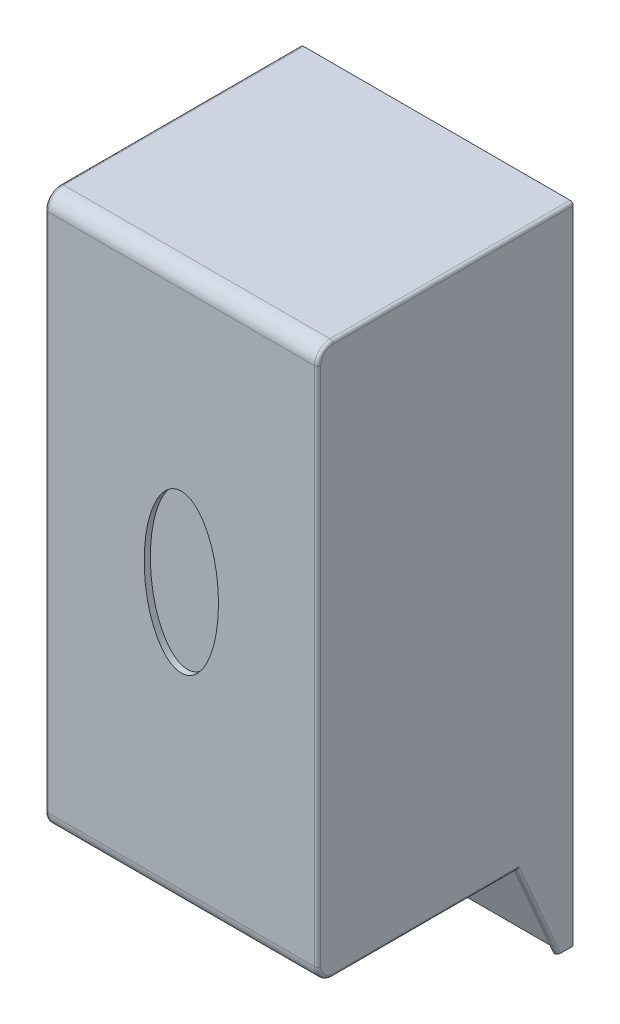
ISO-10303-21;
HEADER;
FILE_DESCRIPTION(('STEP AP214'),'2;1');
FILE_NAME('part.step','',(''),(''),'','','');
FILE_SCHEMA(('AUTOMOTIVE_DESIGN { 1 0 10303 214 1 1 1 1 }'));
ENDSEC;
DATA;
#1=APPLICATION_CONTEXT('core data for automotive mechanical design processes');
#2=APPLICATION_PROTOCOL_DEFINITION('international standard','automotive_design',2000,#1);
#3=PRODUCT_CONTEXT('',#1,'mechanical');
#4=PRODUCT('Part','Part','',(#3));
#5=PRODUCT_RELATED_PRODUCT_CATEGORY('part','',(#4));
#6=PRODUCT_DEFINITION_FORMATION('','',#4);
#7=PRODUCT_DEFINITION_CONTEXT('part definition',#1,'design');
#8=PRODUCT_DEFINITION('design','',#6,#7);
#9=PRODUCT_DEFINITION_SHAPE('','',#8);
#10=(LENGTH_UNIT() NAMED_UNIT(*) SI_UNIT(.MILLI.,.METRE.));
#11=(NAMED_UNIT(*) PLANE_ANGLE_UNIT() SI_UNIT($,.RADIAN.));
#12=(NAMED_UNIT(*) SI_UNIT($,.STERADIAN.) SOLID_ANGLE_UNIT());
#13=UNCERTAINTY_MEASURE_WITH_UNIT(LENGTH_MEASURE(1.E-05),#10,'distance_accuracy_value','');
#14=(GEOMETRIC_REPRESENTATION_CONTEXT(3) GLOBAL_UNCERTAINTY_ASSIGNED_CONTEXT((#13)) GLOBAL_UNIT_ASSIGNED_CONTEXT((#10,
#11,#12)) REPRESENTATION_CONTEXT('',''));
#15=CARTESIAN_POINT('',(0.,0.,0.));
#16=DIRECTION('',(0.,0.,1.));
#17=DIRECTION('',(1.,0.,0.));
#18=AXIS2_PLACEMENT_3D('',#15,#16,#17);
#19=CARTESIAN_POINT('',(0.,0.,104.775));
#20=DIRECTION('',(0.,1.,0.));
#21=DIRECTION('',(0.,0.,1.));
#22=AXIS2_PLACEMENT_3D('',#19,#20,#21);
#23=PLANE('',#22);
#24=DIRECTION('',(0.,0.,-1.));
#25=VECTOR('',#24,1.);
#26=CARTESIAN_POINT('',(111.76,0.,104.775));
#27=LINE('',#26,#25);
#28=CARTESIAN_POINT('',(111.76,0.,5.21196916129492));
#29=VERTEX_POINT('',#28);
#30=CARTESIAN_POINT('',(111.76,0.,0.));
#31=VERTEX_POINT('',#30);
#32=EDGE_CURVE('E220',#29,#31,#27,.T.);
#33=ORIENTED_EDGE('',*,*,#32,.F.);
#34=CARTESIAN_POINT('',(110.49,0.,5.21196916129491));
#35=DIRECTION('',(0.,1.,0.));
#36=DIRECTION('',(0.,0.,1.));
#37=AXIS2_PLACEMENT_3D('',#34,#35,#36);
#38=ELLIPSE('',#37,1.38421586764579,1.27);
#39=CARTESIAN_POINT('',(110.49,0.,6.59618502894071));
#40=VERTEX_POINT('',#39);
#41=EDGE_CURVE('E193',#29,#40,#38,.F.);
#42=ORIENTED_EDGE('',*,*,#41,.T.);
#43=DIRECTION('',(0.,0.,-1.));
#44=VECTOR('',#43,1.);
#45=CARTESIAN_POINT('',(110.49,0.,104.775025));
#46=LINE('',#45,#44);
#47=CARTESIAN_POINT('',(110.49,0.,0.));
#48=VERTEX_POINT('',#47);
#49=EDGE_CURVE('E175',#40,#48,#46,.T.);
#50=ORIENTED_EDGE('',*,*,#49,.T.);
#51=DIRECTION('',(1.,0.,0.));
#52=VECTOR('',#51,1.);
#53=CARTESIAN_POINT('',(0.,0.,0.));
#54=LINE('',#53,#52);
#55=EDGE_CURVE('E190',#48,#31,#54,.T.);
#56=ORIENTED_EDGE('',*,*,#55,.T.);
#57=EDGE_LOOP('',(#33,#42,#50,#56));
#58=FACE_BOUND('',#57,.T.);
#59=ADVANCED_FACE('F47',(#58),#23,.F.);
#60=CARTESIAN_POINT('',(0.,0.,104.775));
#61=DIRECTION('',(1.,0.,0.));
#62=DIRECTION('',(0.,0.,-1.));
#63=AXIS2_PLACEMENT_3D('',#60,#61,#62);
#64=PLANE('',#63);
#65=DIRECTION('',(0.,0.,-1.));
#66=VECTOR('',#65,1.);
#67=CARTESIAN_POINT('',(0.,0.,104.775));
#68=LINE('',#67,#66);
#69=CARTESIAN_POINT('',(0.,0.,5.21196916129493));
#70=VERTEX_POINT('',#69);
#71=CARTESIAN_POINT('',(0.,0.,0.));
#72=VERTEX_POINT('',#71);
#73=EDGE_CURVE('E229',#70,#72,#68,.T.);
#74=ORIENTED_EDGE('',*,*,#73,.F.);
#75=DIRECTION('',(0.,-0.917486953938735,-0.397765872533355));
#76=VECTOR('',#75,1.);
#77=CARTESIAN_POINT('',(0.,38.6051626581174,21.9487915684978));
#78=LINE('',#77,#76);
#79=CARTESIAN_POINT('',(0.,39.37,22.2803779647229));
#80=VERTEX_POINT('',#79);
#81=EDGE_CURVE('E400',#70,#80,#78,.F.);
#82=ORIENTED_EDGE('',*,*,#81,.T.);
#83=DIRECTION('',(0.,0.,1.));
#84=VECTOR('',#83,1.);
#85=CARTESIAN_POINT('',(0.,39.37,104.775));
#86=LINE('',#85,#84);
#87=CARTESIAN_POINT('',(0.,39.37,98.425));
#88=VERTEX_POINT('',#87);
#89=EDGE_CURVE('E390',#80,#88,#86,.T.);
#90=ORIENTED_EDGE('',*,*,#89,.T.);
#91=CARTESIAN_POINT('',(0.,44.45,98.425));
#92=DIRECTION('',(1.,0.,0.));
#93=DIRECTION('',(0.,0.,-1.));
#94=AXIS2_PLACEMENT_3D('',#91,#92,#93);
#95=CIRCLE('',#94,5.08);
#96=CARTESIAN_POINT('',(0.,44.45,103.505));
#97=VERTEX_POINT('',#96);
#98=EDGE_CURVE('E387',#88,#97,#95,.F.);
#99=ORIENTED_EDGE('',*,*,#98,.T.);
#100=DIRECTION('',(0.,-1.,0.));
#101=VECTOR('',#100,1.);
#102=CARTESIAN_POINT('',(0.,0.,103.505));
#103=LINE('',#102,#101);
#104=CARTESIAN_POINT('',(0.,257.81,103.505));
#105=VERTEX_POINT('',#104);
#106=EDGE_CURVE('E381',#97,#105,#103,.F.);
#107=ORIENTED_EDGE('',*,*,#106,.T.);
#108=CARTESIAN_POINT('',(0.,257.81,98.425));
#109=DIRECTION('',(1.,0.,0.));
#110=DIRECTION('',(0.,0.,-1.));
#111=AXIS2_PLACEMENT_3D('',#108,#109,#110);
#112=CIRCLE('',#111,5.08);
#113=CARTESIAN_POINT('',(0.,262.89,98.425));
#114=VERTEX_POINT('',#113);
#115=EDGE_CURVE('E393',#105,#114,#112,.F.);
#116=ORIENTED_EDGE('',*,*,#115,.T.);
#117=DIRECTION('',(0.,0.,-1.));
#118=VECTOR('',#117,1.);
#119=CARTESIAN_POINT('',(0.,262.89,104.775));
#120=LINE('',#119,#118);
#121=CARTESIAN_POINT('',(0.,262.89,0.));
#122=VERTEX_POINT('',#121);
#123=EDGE_CURVE('E396',#114,#122,#120,.T.);
#124=ORIENTED_EDGE('',*,*,#123,.T.);
#125=DIRECTION('',(0.,-1.,0.));
#126=VECTOR('',#125,1.);
#127=CARTESIAN_POINT('',(0.,0.,0.));
#128=LINE('',#127,#126);
#129=EDGE_CURVE('E204',#122,#72,#128,.T.);
#130=ORIENTED_EDGE('',*,*,#129,.T.);
#131=EDGE_LOOP('',(#74,#82,#90,#99,#107,#116,#124,#130));
#132=FACE_BOUND('',#131,.T.);
#133=ADVANCED_FACE('F483',(#132),#64,.F.);
#134=DIRECTION('',(0.,0.,-1.));
#135=VECTOR('',#134,1.);
#136=CARTESIAN_POINT('',(1.26999999999999,0.,104.775025));
#137=LINE('',#136,#135);
#138=CARTESIAN_POINT('',(1.26999999999999,0.,6.59618502894071));
#139=VERTEX_POINT('',#138);
#140=CARTESIAN_POINT('',(1.26999999999999,0.,0.));
#141=VERTEX_POINT('',#140);
#142=EDGE_CURVE('E195',#139,#141,#137,.T.);
#143=ORIENTED_EDGE('',*,*,#142,.F.);
#144=CARTESIAN_POINT('',(1.27,0.,5.21196916129493));
#145=DIRECTION('',(0.,1.,0.));
#146=DIRECTION('',(0.,0.,1.));
#147=AXIS2_PLACEMENT_3D('',#144,#145,#146);
#148=ELLIPSE('',#147,1.38421586764579,1.27);
#149=EDGE_CURVE('E256',#139,#70,#148,.F.);
#150=ORIENTED_EDGE('',*,*,#149,.T.);
#151=ORIENTED_EDGE('',*,*,#73,.T.);
#152=EDGE_CURVE('E203',#72,#141,#54,.T.);
#153=ORIENTED_EDGE('',*,*,#152,.T.);
#154=EDGE_LOOP('',(#143,#150,#151,#153));
#155=FACE_BOUND('',#154,.T.);
#156=ADVANCED_FACE('F485',(#155),#23,.F.);
#157=CARTESIAN_POINT('',(111.76,0.,104.775));
#158=DIRECTION('',(-1.,0.,0.));
#159=DIRECTION('',(0.,0.,1.));
#160=AXIS2_PLACEMENT_3D('',#157,#158,#159);
#161=PLANE('',#160);
#162=DIRECTION('',(0.,0.,1.));
#163=VECTOR('',#162,1.);
#164=CARTESIAN_POINT('',(111.76,39.37,104.775));
#165=LINE('',#164,#163);
#166=CARTESIAN_POINT('',(111.76,39.37,98.425));
#167=VERTEX_POINT('',#166);
#168=CARTESIAN_POINT('',(111.76,39.37,22.2803779647228));
#169=VERTEX_POINT('',#168);
#170=EDGE_CURVE('E65',#167,#169,#165,.F.);
#171=ORIENTED_EDGE('',*,*,#170,.T.);
#172=DIRECTION('',(0.,-0.917486953938735,-0.397765872533355));
#173=VECTOR('',#172,1.);
#174=CARTESIAN_POINT('',(111.76,0.50516265811737,5.43097659743851));
#175=LINE('',#174,#173);
#176=EDGE_CURVE('E245',#169,#29,#175,.T.);
#177=ORIENTED_EDGE('',*,*,#176,.T.);
#178=ORIENTED_EDGE('',*,*,#32,.T.);
#179=DIRECTION('',(0.,1.,0.));
#180=VECTOR('',#179,1.);
#181=CARTESIAN_POINT('',(111.76,0.,0.));
#182=LINE('',#181,#180);
#183=CARTESIAN_POINT('',(111.76,262.89,0.));
#184=VERTEX_POINT('',#183);
#185=EDGE_CURVE('E201',#31,#184,#182,.T.);
#186=ORIENTED_EDGE('',*,*,#185,.T.);
#187=DIRECTION('',(0.,0.,-1.));
#188=VECTOR('',#187,1.);
#189=CARTESIAN_POINT('',(111.76,262.89,104.775));
#190=LINE('',#189,#188);
#191=CARTESIAN_POINT('',(111.76,262.89,98.425));
#192=VERTEX_POINT('',#191);
#193=EDGE_CURVE('E238',#184,#192,#190,.F.);
#194=ORIENTED_EDGE('',*,*,#193,.T.);
#195=CARTESIAN_POINT('',(111.76,257.81,98.425));
#196=DIRECTION('',(-1.,0.,0.));
#197=DIRECTION('',(0.,0.,1.));
#198=AXIS2_PLACEMENT_3D('',#195,#196,#197);
#199=CIRCLE('',#198,5.08);
#200=CARTESIAN_POINT('',(111.76,257.81,103.505));
#201=VERTEX_POINT('',#200);
#202=EDGE_CURVE('E235',#192,#201,#199,.F.);
#203=ORIENTED_EDGE('',*,*,#202,.T.);
#204=DIRECTION('',(0.,1.,0.));
#205=VECTOR('',#204,1.);
#206=CARTESIAN_POINT('',(111.76,0.,103.505));
#207=LINE('',#206,#205);
#208=CARTESIAN_POINT('',(111.76,44.45,103.505));
#209=VERTEX_POINT('',#208);
#210=EDGE_CURVE('E232',#201,#209,#207,.F.);
#211=ORIENTED_EDGE('',*,*,#210,.T.);
#212=CARTESIAN_POINT('',(111.76,44.45,98.425));
#213=DIRECTION('',(-1.,0.,0.));
#214=DIRECTION('',(0.,0.,1.));
#215=AXIS2_PLACEMENT_3D('',#212,#213,#214);
#216=CIRCLE('',#215,5.08);
#217=EDGE_CURVE('E70',#209,#167,#216,.F.);
#218=ORIENTED_EDGE('',*,*,#217,.T.);
#219=EDGE_LOOP('',(#171,#177,#178,#186,#194,#203,#211,#218));
#220=FACE_BOUND('',#219,.T.);
#221=ADVANCED_FACE('F319',(#220),#161,.F.);
#222=CARTESIAN_POINT('',(0.,264.16,104.775));
#223=DIRECTION('',(0.,-1.,0.));
#224=DIRECTION('',(0.,0.,-1.));
#225=AXIS2_PLACEMENT_3D('',#222,#223,#224);
#226=PLANE('',#225);
#227=DIRECTION('',(-1.,0.,0.));
#228=VECTOR('',#227,1.);
#229=CARTESIAN_POINT('',(0.,264.16,0.));
#230=LINE('',#229,#228);
#231=CARTESIAN_POINT('',(110.49,264.16,0.));
#232=VERTEX_POINT('',#231);
#233=CARTESIAN_POINT('',(1.27,264.16,0.));
#234=VERTEX_POINT('',#233);
#235=EDGE_CURVE('E216',#232,#234,#230,.T.);
#236=ORIENTED_EDGE('',*,*,#235,.T.);
#237=DIRECTION('',(0.,0.,-1.));
#238=VECTOR('',#237,1.);
#239=CARTESIAN_POINT('',(1.27,264.16,104.775));
#240=LINE('',#239,#238);
#241=CARTESIAN_POINT('',(1.27,264.16,98.425));
#242=VERTEX_POINT('',#241);
#243=EDGE_CURVE('E410',#234,#242,#240,.F.);
#244=ORIENTED_EDGE('',*,*,#243,.T.);
#245=DIRECTION('',(-1.,0.,0.));
#246=VECTOR('',#245,1.);
#247=CARTESIAN_POINT('',(0.,264.16,98.425));
#248=LINE('',#247,#246);
#249=CARTESIAN_POINT('',(110.49,264.16,98.425));
#250=VERTEX_POINT('',#249);
#251=EDGE_CURVE('E377',#242,#250,#248,.F.);
#252=ORIENTED_EDGE('',*,*,#251,.T.);
#253=DIRECTION('',(0.,0.,-1.));
#254=VECTOR('',#253,1.);
#255=CARTESIAN_POINT('',(110.49,264.16,104.775));
#256=LINE('',#255,#254);
#257=EDGE_CURVE('E327',#250,#232,#256,.T.);
#258=ORIENTED_EDGE('',*,*,#257,.T.);
#259=EDGE_LOOP('',(#236,#244,#252,#258));
#260=FACE_BOUND('',#259,.T.);
#261=ADVANCED_FACE('F497',(#260),#226,.F.);
#262=CARTESIAN_POINT('',(0.,0.,104.775));
#263=DIRECTION('',(0.,0.,-1.));
#264=DIRECTION('',(-1.,0.,0.));
#265=AXIS2_PLACEMENT_3D('',#262,#263,#264);
#266=PLANE('',#265);
#267=CARTESIAN_POINT('',(55.88,153.663476033198,104.775));
#268=DIRECTION('',(0.,0.,1.));
#269=DIRECTION('',(0.,1.,0.));
#270=AXIS2_PLACEMENT_3D('',#267,#268,#269);
#271=ELLIPSE('',#270,32.288266671506,15.2371595528455);
#272=CARTESIAN_POINT('',(55.88,185.951742704704,104.775));
#273=VERTEX_POINT('',#272);
#274=EDGE_CURVE('E545',#273,#273,#271,.T.);
#275=ORIENTED_EDGE('',*,*,#274,.F.);
#276=EDGE_LOOP('',(#275));
#277=FACE_BOUND('',#276,.T.);
#278=DIRECTION('',(-1.,0.,0.));
#279=VECTOR('',#278,1.);
#280=CARTESIAN_POINT('',(0.,257.81,104.775));
#281=LINE('',#280,#279);
#282=CARTESIAN_POINT('',(110.49,257.81,104.775));
#283=VERTEX_POINT('',#282);
#284=CARTESIAN_POINT('',(1.27,257.81,104.775));
#285=VERTEX_POINT('',#284);
#286=EDGE_CURVE('E361',#283,#285,#281,.T.);
#287=ORIENTED_EDGE('',*,*,#286,.T.);
#288=DIRECTION('',(0.,-1.,0.));
#289=VECTOR('',#288,1.);
#290=CARTESIAN_POINT('',(1.27,0.,104.775));
#291=LINE('',#290,#289);
#292=CARTESIAN_POINT('',(1.27,44.45,104.775));
#293=VERTEX_POINT('',#292);
#294=EDGE_CURVE('E12',#285,#293,#291,.T.);
#295=ORIENTED_EDGE('',*,*,#294,.T.);
#296=DIRECTION('',(-1.,0.,0.));
#297=VECTOR('',#296,1.);
#298=CARTESIAN_POINT('',(0.,44.45,104.775));
#299=LINE('',#298,#297);
#300=CARTESIAN_POINT('',(110.49,44.45,104.775));
#301=VERTEX_POINT('',#300);
#302=EDGE_CURVE('E367',#293,#301,#299,.F.);
#303=ORIENTED_EDGE('',*,*,#302,.T.);
#304=DIRECTION('',(0.,1.,0.));
#305=VECTOR('',#304,1.);
#306=CARTESIAN_POINT('',(110.49,0.,104.775));
#307=LINE('',#306,#305);
#308=EDGE_CURVE('E57',#301,#283,#307,.T.);
#309=ORIENTED_EDGE('',*,*,#308,.T.);
#310=EDGE_LOOP('',(#287,#295,#303,#309));
#311=FACE_BOUND('',#310,.T.);
#312=ADVANCED_FACE('F440',(#277,#311),#266,.F.);
#313=CARTESIAN_POINT('',(0.,0.,0.));
#314=DIRECTION('',(0.,0.,-1.));
#315=DIRECTION('',(-1.,0.,0.));
#316=AXIS2_PLACEMENT_3D('',#313,#314,#315);
#317=PLANE('',#316);
#318=ORIENTED_EDGE('',*,*,#129,.F.);
#319=CARTESIAN_POINT('',(1.27,262.89,0.));
#320=DIRECTION('',(0.,0.,-1.));
#321=DIRECTION('',(-1.,0.,0.));
#322=AXIS2_PLACEMENT_3D('',#319,#320,#321);
#323=CIRCLE('',#322,1.27);
#324=EDGE_CURVE('E405',#122,#234,#323,.T.);
#325=ORIENTED_EDGE('',*,*,#324,.T.);
#326=ORIENTED_EDGE('',*,*,#235,.F.);
#327=CARTESIAN_POINT('',(110.49,262.89,0.));
#328=DIRECTION('',(0.,0.,-1.));
#329=DIRECTION('',(-1.,0.,0.));
#330=AXIS2_PLACEMENT_3D('',#327,#328,#329);
#331=CIRCLE('',#330,1.27);
#332=EDGE_CURVE('E325',#232,#184,#331,.T.);
#333=ORIENTED_EDGE('',*,*,#332,.T.);
#334=ORIENTED_EDGE('',*,*,#185,.F.);
#335=ORIENTED_EDGE('',*,*,#55,.F.);
#336=DIRECTION('',(0.,-1.,0.));
#337=VECTOR('',#336,1.);
#338=CARTESIAN_POINT('',(110.49,0.,0.));
#339=LINE('',#338,#337);
#340=CARTESIAN_POINT('',(110.49,3.79345037000897,0.));
#341=VERTEX_POINT('',#340);
#342=EDGE_CURVE('E172',#341,#48,#339,.T.);
#343=ORIENTED_EDGE('',*,*,#342,.F.);
#344=DIRECTION('',(1.,0.,0.));
#345=VECTOR('',#344,1.);
#346=CARTESIAN_POINT('',(110.49,3.79345037000897,0.));
#347=LINE('',#346,#345);
#348=CARTESIAN_POINT('',(1.26999999999999,3.79345037000897,0.));
#349=VERTEX_POINT('',#348);
#350=EDGE_CURVE('E196',#349,#341,#347,.T.);
#351=ORIENTED_EDGE('',*,*,#350,.F.);
#352=DIRECTION('',(0.,1.,0.));
#353=VECTOR('',#352,1.);
#354=CARTESIAN_POINT('',(1.26999999999999,0.,0.));
#355=LINE('',#354,#353);
#356=EDGE_CURVE('E184',#141,#349,#355,.T.);
#357=ORIENTED_EDGE('',*,*,#356,.F.);
#358=ORIENTED_EDGE('',*,*,#152,.F.);
#359=EDGE_LOOP('',(#318,#325,#326,#333,#334,#335,#343,#351,#357,#358));
#360=FACE_BOUND('',#359,.T.);
#361=ADVANCED_FACE('F199',(#360),#317,.T.);
#362=CARTESIAN_POINT('',(0.,38.1,23.114));
#363=DIRECTION('',(0.,1.,0.));
#364=DIRECTION('',(0.,0.,1.));
#365=AXIS2_PLACEMENT_3D('',#362,#363,#364);
#366=PLANE('',#365);
#367=CARTESIAN_POINT('',(55.88,38.1,64.4026671483138));
#368=DIRECTION('',(0.,1.,0.));
#369=DIRECTION('',(0.,0.,1.));
#370=AXIS2_PLACEMENT_3D('',#367,#368,#369);
#371=CIRCLE('',#370,5.04052757152039);
#372=CARTESIAN_POINT('',(55.88,38.1,69.4431947198342));
#373=VERTEX_POINT('',#372);
#374=EDGE_CURVE('E370',#373,#373,#371,.F.);
#375=ORIENTED_EDGE('',*,*,#374,.F.);
#376=EDGE_LOOP('',(#375));
#377=FACE_BOUND('',#376,.T.);
#378=DIRECTION('',(-1.,0.,0.));
#379=VECTOR('',#378,1.);
#380=CARTESIAN_POINT('',(0.,38.1,98.425));
#381=LINE('',#380,#379);
#382=CARTESIAN_POINT('',(110.49,38.1,98.425));
#383=VERTEX_POINT('',#382);
#384=CARTESIAN_POINT('',(1.27,38.1,98.425));
#385=VERTEX_POINT('',#384);
#386=EDGE_CURVE('E351',#383,#385,#381,.T.);
#387=ORIENTED_EDGE('',*,*,#386,.T.);
#388=DIRECTION('',(0.,0.,1.));
#389=VECTOR('',#388,1.);
#390=CARTESIAN_POINT('',(1.27,38.1,23.114));
#391=LINE('',#390,#389);
#392=CARTESIAN_POINT('',(1.27,38.1,23.114));
#393=VERTEX_POINT('',#392);
#394=EDGE_CURVE('E346',#385,#393,#391,.F.);
#395=ORIENTED_EDGE('',*,*,#394,.T.);
#396=CARTESIAN_POINT('',(110.49,38.1,23.114));
#397=DIRECTION('',(-1.,0.,0.));
#398=VECTOR('',#397,1.);
#399=LINE('',#396,#398);
#400=CARTESIAN_POINT('',(110.49,38.1,23.114));
#401=VERTEX_POINT('',#400);
#402=EDGE_CURVE('E210',#401,#393,#399,.T.);
#403=ORIENTED_EDGE('',*,*,#402,.F.);
#404=DIRECTION('',(0.,0.,1.));
#405=VECTOR('',#404,1.);
#406=CARTESIAN_POINT('',(110.49,38.1,23.114));
#407=LINE('',#406,#405);
#408=EDGE_CURVE('E315',#401,#383,#407,.T.);
#409=ORIENTED_EDGE('',*,*,#408,.T.);
#410=EDGE_LOOP('',(#387,#395,#403,#409));
#411=FACE_BOUND('',#410,.T.);
#412=ADVANCED_FACE('F350',(#377,#411),#366,.F.);
#413=CARTESIAN_POINT('',(0.,-2.40724473728277,5.55255187512201));
#414=DIRECTION('',(0.,-0.397765872533355,0.917486953938735));
#415=DIRECTION('',(0.,-0.917486953938735,-0.397765872533355));
#416=AXIS2_PLACEMENT_3D('',#413,#414,#415);
#417=PLANE('',#416);
#418=ORIENTED_EDGE('',*,*,#402,.T.);
#419=DIRECTION('',(0.,-0.917486953938735,-0.397765872533355));
#420=VECTOR('',#419,1.);
#421=CARTESIAN_POINT('',(1.27,0.,6.59618502894072));
#422=LINE('',#421,#420);
#423=CARTESIAN_POINT('',(1.26999999999999,3.79345037000897,8.24079162510094));
#424=VERTEX_POINT('',#423);
#425=EDGE_CURVE('E251',#393,#424,#422,.T.);
#426=ORIENTED_EDGE('',*,*,#425,.T.);
#427=DIRECTION('',(-1.,0.,0.));
#428=VECTOR('',#427,1.);
#429=CARTESIAN_POINT('',(0.,3.79345037000897,8.24079162510094));
#430=LINE('',#429,#428);
#431=CARTESIAN_POINT('',(110.49,3.79345037000897,8.24079162510094));
#432=VERTEX_POINT('',#431);
#433=EDGE_CURVE('E452',#432,#424,#430,.T.);
#434=ORIENTED_EDGE('',*,*,#433,.F.);
#435=DIRECTION('',(0.,-0.917486953938735,-0.397765872533355));
#436=VECTOR('',#435,1.);
#437=CARTESIAN_POINT('',(110.49,38.1,23.114));
#438=LINE('',#437,#436);
#439=EDGE_CURVE('E248',#432,#401,#438,.F.);
#440=ORIENTED_EDGE('',*,*,#439,.T.);
#441=EDGE_LOOP('',(#418,#426,#434,#440));
#442=FACE_BOUND('',#441,.T.);
#443=ADVANCED_FACE('F425',(#442),#417,.T.);
#444=CARTESIAN_POINT('',(110.49,0.,104.775025));
#445=DIRECTION('',(1.,0.,0.));
#446=DIRECTION('',(0.,0.,-1.));
#447=AXIS2_PLACEMENT_3D('',#444,#445,#446);
#448=PLANE('',#447);
#449=DIRECTION('',(0.,0.917486953938735,0.397765872533355));
#450=VECTOR('',#449,1.);
#451=CARTESIAN_POINT('',(110.49,-2.40724473728277,5.55255187512201));
#452=LINE('',#451,#450);
#453=EDGE_CURVE('E458',#40,#432,#452,.T.);
#454=ORIENTED_EDGE('',*,*,#453,.T.);
#455=DIRECTION('',(0.,0.,-1.));
#456=VECTOR('',#455,1.);
#457=CARTESIAN_POINT('',(110.49,3.79345037000897,104.775025));
#458=LINE('',#457,#456);
#459=EDGE_CURVE('E178',#432,#341,#458,.T.);
#460=ORIENTED_EDGE('',*,*,#459,.T.);
#461=ORIENTED_EDGE('',*,*,#342,.T.);
#462=ORIENTED_EDGE('',*,*,#49,.F.);
#463=EDGE_LOOP('',(#454,#460,#461,#462));
#464=FACE_BOUND('',#463,.T.);
#465=ADVANCED_FACE('F174',(#464),#448,.F.);
#466=CARTESIAN_POINT('',(110.49,3.79345037000897,104.775025));
#467=DIRECTION('',(0.,1.,0.));
#468=DIRECTION('',(0.,0.,1.));
#469=AXIS2_PLACEMENT_3D('',#466,#467,#468);
#470=PLANE('',#469);
#471=ORIENTED_EDGE('',*,*,#433,.T.);
#472=DIRECTION('',(0.,0.,-1.));
#473=VECTOR('',#472,1.);
#474=CARTESIAN_POINT('',(1.26999999999999,3.79345037000897,104.775025));
#475=LINE('',#474,#473);
#476=EDGE_CURVE('E506',#424,#349,#475,.T.);
#477=ORIENTED_EDGE('',*,*,#476,.T.);
#478=ORIENTED_EDGE('',*,*,#350,.T.);
#479=ORIENTED_EDGE('',*,*,#459,.F.);
#480=EDGE_LOOP('',(#471,#477,#478,#479));
#481=FACE_BOUND('',#480,.T.);
#482=ADVANCED_FACE('F529',(#481),#470,.F.);
#483=CARTESIAN_POINT('',(1.26999999999999,0.,104.775025));
#484=DIRECTION('',(-1.,0.,0.));
#485=DIRECTION('',(0.,0.,1.));
#486=AXIS2_PLACEMENT_3D('',#483,#484,#485);
#487=PLANE('',#486);
#488=DIRECTION('',(0.,-0.917486953938735,-0.397765872533355));
#489=VECTOR('',#488,1.);
#490=CARTESIAN_POINT('',(1.26999999999999,-2.40724473728277,5.55255187512201));
#491=LINE('',#490,#489);
#492=EDGE_CURVE('E384',#424,#139,#491,.T.);
#493=ORIENTED_EDGE('',*,*,#492,.T.);
#494=ORIENTED_EDGE('',*,*,#142,.T.);
#495=ORIENTED_EDGE('',*,*,#356,.T.);
#496=ORIENTED_EDGE('',*,*,#476,.F.);
#497=EDGE_LOOP('',(#493,#494,#495,#496));
#498=FACE_BOUND('',#497,.T.);
#499=ADVANCED_FACE('F531',(#498),#487,.F.);
#500=CARTESIAN_POINT('',(55.88,153.663476033198,102.235));
#501=DIRECTION('',(0.,0.,1.));
#502=DIRECTION('',(0.,1.,0.));
#503=AXIS2_PLACEMENT_3D('',#500,#501,#502);
#504=ELLIPSE('',#503,32.288266671506,15.2371595528455);
#505=DIRECTION('',(0.,0.,1.));
#506=VECTOR('',#505,1.);
#507=SURFACE_OF_LINEAR_EXTRUSION('',#504,#506);
#508=CARTESIAN_POINT('',(55.88,185.951742704704,102.235));
#509=VERTEX_POINT('',#508);
#510=EDGE_CURVE('E185',#509,#509,#504,.T.);
#511=ORIENTED_EDGE('',*,*,#510,.F.);
#512=EDGE_LOOP('',(#511));
#513=FACE_BOUND('',#512,.T.);
#514=ORIENTED_EDGE('',*,*,#274,.T.);
#515=EDGE_LOOP('',(#514));
#516=FACE_BOUND('',#515,.T.);
#517=ADVANCED_FACE('F478',(#513,#516),#507,.F.);
#518=CARTESIAN_POINT('',(55.88,153.663476033198,102.235));
#519=DIRECTION('',(0.,0.,1.));
#520=DIRECTION('',(1.,0.,0.));
#521=AXIS2_PLACEMENT_3D('',#518,#519,#520);
#522=PLANE('',#521);
#523=ORIENTED_EDGE('',*,*,#510,.T.);
#524=EDGE_LOOP('',(#523));
#525=FACE_BOUND('',#524,.T.);
#526=ADVANCED_FACE('F468',(#525),#522,.T.);
#527=CARTESIAN_POINT('',(55.88,31.75,64.4026671483138));
#528=DIRECTION('',(0.,1.,0.));
#529=DIRECTION('',(0.,0.,1.));
#530=AXIS2_PLACEMENT_3D('',#527,#528,#529);
#531=CYLINDRICAL_SURFACE('',#530,5.04052757152039);
#532=CARTESIAN_POINT('',(55.88,31.75,64.4026671483138));
#533=DIRECTION('',(0.,-1.,0.));
#534=DIRECTION('',(0.,0.,-1.));
#535=AXIS2_PLACEMENT_3D('',#532,#533,#534);
#536=CIRCLE('',#535,5.04052757152039);
#537=CARTESIAN_POINT('',(55.88,31.75,59.3621395767934));
#538=VERTEX_POINT('',#537);
#539=EDGE_CURVE('E546',#538,#538,#536,.T.);
#540=ORIENTED_EDGE('',*,*,#539,.F.);
#541=EDGE_LOOP('',(#540));
#542=FACE_BOUND('',#541,.T.);
#543=ORIENTED_EDGE('',*,*,#374,.T.);
#544=EDGE_LOOP('',(#543));
#545=FACE_BOUND('',#544,.T.);
#546=ADVANCED_FACE('F465',(#542,#545),#531,.T.);
#547=CARTESIAN_POINT('',(55.88,31.75,64.4026671483138));
#548=DIRECTION('',(0.,-1.,0.));
#549=DIRECTION('',(0.,0.,-1.));
#550=AXIS2_PLACEMENT_3D('',#547,#548,#549);
#551=PLANE('',#550);
#552=CARTESIAN_POINT('',(55.88,31.75,64.4026671483138));
#553=DIRECTION('',(0.,-1.,0.));
#554=DIRECTION('',(0.,0.,-1.));
#555=AXIS2_PLACEMENT_3D('',#552,#553,#554);
#556=CIRCLE('',#555,2.39816846598759);
#557=CARTESIAN_POINT('',(55.88,31.75,62.0044986823262));
#558=VERTEX_POINT('',#557);
#559=EDGE_CURVE('E362',#558,#558,#556,.T.);
#560=ORIENTED_EDGE('',*,*,#559,.F.);
#561=EDGE_LOOP('',(#560));
#562=FACE_BOUND('',#561,.T.);
#563=ORIENTED_EDGE('',*,*,#539,.T.);
#564=EDGE_LOOP('',(#563));
#565=FACE_BOUND('',#564,.T.);
#566=ADVANCED_FACE('F467',(#562,#565),#551,.T.);
#567=CARTESIAN_POINT('',(55.88,29.21,64.4026671483138));
#568=DIRECTION('',(0.,1.,0.));
#569=DIRECTION('',(0.,0.,1.));
#570=AXIS2_PLACEMENT_3D('',#567,#568,#569);
#571=CYLINDRICAL_SURFACE('',#570,2.39816846598759);
#572=CARTESIAN_POINT('',(55.88,29.21,64.4026671483138));
#573=DIRECTION('',(0.,-1.,0.));
#574=DIRECTION('',(0.,0.,-1.));
#575=AXIS2_PLACEMENT_3D('',#572,#573,#574);
#576=CIRCLE('',#575,2.39816846598759);
#577=CARTESIAN_POINT('',(55.88,29.21,62.0044986823262));
#578=VERTEX_POINT('',#577);
#579=EDGE_CURVE('E290',#578,#578,#576,.T.);
#580=ORIENTED_EDGE('',*,*,#579,.F.);
#581=EDGE_LOOP('',(#580));
#582=FACE_BOUND('',#581,.T.);
#583=ORIENTED_EDGE('',*,*,#559,.T.);
#584=EDGE_LOOP('',(#583));
#585=FACE_BOUND('',#584,.T.);
#586=ADVANCED_FACE('F475',(#582,#585),#571,.T.);
#587=CARTESIAN_POINT('',(55.88,29.21,64.4026671483138));
#588=DIRECTION('',(0.,-1.,0.));
#589=DIRECTION('',(0.,0.,-1.));
#590=AXIS2_PLACEMENT_3D('',#587,#588,#589);
#591=PLANE('',#590);
#592=ORIENTED_EDGE('',*,*,#579,.T.);
#593=EDGE_LOOP('',(#592));
#594=FACE_BOUND('',#593,.T.);
#595=ADVANCED_FACE('F559',(#594),#591,.T.);
#596=CARTESIAN_POINT('',(0.,44.45,98.425));
#597=DIRECTION('',(-1.,0.,0.));
#598=DIRECTION('',(0.,0.,1.));
#599=AXIS2_PLACEMENT_3D('',#596,#597,#598);
#600=CYLINDRICAL_SURFACE('',#599,6.35);
#601=ORIENTED_EDGE('',*,*,#302,.F.);
#602=CARTESIAN_POINT('',(1.27,44.45,98.425));
#603=DIRECTION('',(1.,0.,0.));
#604=DIRECTION('',(0.,0.,-1.));
#605=AXIS2_PLACEMENT_3D('',#602,#603,#604);
#606=CIRCLE('',#605,6.35);
#607=EDGE_CURVE('E230',#293,#385,#606,.T.);
#608=ORIENTED_EDGE('',*,*,#607,.T.);
#609=ORIENTED_EDGE('',*,*,#386,.F.);
#610=CARTESIAN_POINT('',(110.49,44.45,98.425));
#611=DIRECTION('',(-1.,0.,0.));
#612=DIRECTION('',(0.,0.,1.));
#613=AXIS2_PLACEMENT_3D('',#610,#611,#612);
#614=CIRCLE('',#613,6.35);
#615=EDGE_CURVE('E340',#383,#301,#614,.T.);
#616=ORIENTED_EDGE('',*,*,#615,.T.);
#617=EDGE_LOOP('',(#601,#608,#609,#616));
#618=FACE_BOUND('',#617,.T.);
#619=ADVANCED_FACE('F358',(#618),#600,.T.);
#620=CARTESIAN_POINT('',(0.,257.81,98.425));
#621=DIRECTION('',(-1.,0.,0.));
#622=DIRECTION('',(0.,0.,1.));
#623=AXIS2_PLACEMENT_3D('',#620,#621,#622);
#624=CYLINDRICAL_SURFACE('',#623,6.35);
#625=ORIENTED_EDGE('',*,*,#251,.F.);
#626=CARTESIAN_POINT('',(1.27,257.81,98.425));
#627=DIRECTION('',(1.,0.,0.));
#628=DIRECTION('',(0.,0.,-1.));
#629=AXIS2_PLACEMENT_3D('',#626,#627,#628);
#630=CIRCLE('',#629,6.35);
#631=EDGE_CURVE('E356',#242,#285,#630,.T.);
#632=ORIENTED_EDGE('',*,*,#631,.T.);
#633=ORIENTED_EDGE('',*,*,#286,.F.);
#634=CARTESIAN_POINT('',(110.49,257.81,98.425));
#635=DIRECTION('',(-1.,0.,0.));
#636=DIRECTION('',(0.,0.,1.));
#637=AXIS2_PLACEMENT_3D('',#634,#635,#636);
#638=CIRCLE('',#637,6.35);
#639=EDGE_CURVE('E413',#283,#250,#638,.T.);
#640=ORIENTED_EDGE('',*,*,#639,.T.);
#641=EDGE_LOOP('',(#625,#632,#633,#640));
#642=FACE_BOUND('',#641,.T.);
#643=ADVANCED_FACE('F572',(#642),#624,.T.);
#644=CARTESIAN_POINT('',(1.27,-1.90208207916541,4.38734344361981));
#645=DIRECTION('',(0.,0.917486953938735,0.397765872533355));
#646=DIRECTION('',(0.,-0.397765872533355,0.917486953938735));
#647=AXIS2_PLACEMENT_3D('',#644,#645,#646);
#648=CYLINDRICAL_SURFACE('',#647,1.27);
#649=ORIENTED_EDGE('',*,*,#492,.F.);
#650=ORIENTED_EDGE('',*,*,#425,.F.);
#651=CARTESIAN_POINT('',(1.27,39.37,22.2803779647229));
#652=DIRECTION('',(0.,0.548741345019056,0.835992186725855));
#653=DIRECTION('',(0.,-0.835992186725855,0.548741345019056));
#654=AXIS2_PLACEMENT_3D('',#651,#652,#653);
#655=ELLIPSE('',#654,1.51915295401734,1.27);
#656=EDGE_CURVE('E286',#80,#393,#655,.T.);
#657=ORIENTED_EDGE('',*,*,#656,.F.);
#658=ORIENTED_EDGE('',*,*,#81,.F.);
#659=ORIENTED_EDGE('',*,*,#149,.F.);
#660=EDGE_LOOP('',(#649,#650,#657,#658,#659));
#661=FACE_BOUND('',#660,.T.);
#662=ADVANCED_FACE('F510',(#661),#648,.T.);
#663=CARTESIAN_POINT('',(1.27,39.37,104.775));
#664=DIRECTION('',(0.,0.,1.));
#665=DIRECTION('',(1.,0.,0.));
#666=AXIS2_PLACEMENT_3D('',#663,#664,#665);
#667=CYLINDRICAL_SURFACE('',#666,1.27);
#668=ORIENTED_EDGE('',*,*,#656,.T.);
#669=ORIENTED_EDGE('',*,*,#394,.F.);
#670=CARTESIAN_POINT('',(1.27,39.37,98.425));
#671=DIRECTION('',(0.,0.,1.));
#672=DIRECTION('',(1.,0.,0.));
#673=AXIS2_PLACEMENT_3D('',#670,#671,#672);
#674=CIRCLE('',#673,1.27);
#675=EDGE_CURVE('E282',#88,#385,#674,.T.);
#676=ORIENTED_EDGE('',*,*,#675,.F.);
#677=ORIENTED_EDGE('',*,*,#89,.F.);
#678=EDGE_LOOP('',(#668,#669,#676,#677));
#679=FACE_BOUND('',#678,.T.);
#680=ADVANCED_FACE('F595',(#679),#667,.T.);
#681=CARTESIAN_POINT('',(1.27,44.45,98.425));
#682=DIRECTION('',(1.,0.,0.));
#683=DIRECTION('',(0.,0.,-1.));
#684=AXIS2_PLACEMENT_3D('',#681,#682,#683);
#685=TOROIDAL_SURFACE('',#684,5.08,1.27);
#686=ORIENTED_EDGE('',*,*,#675,.T.);
#687=ORIENTED_EDGE('',*,*,#607,.F.);
#688=CARTESIAN_POINT('',(1.27,44.45,103.505));
#689=DIRECTION('',(0.,1.,0.));
#690=DIRECTION('',(0.,0.,1.));
#691=AXIS2_PLACEMENT_3D('',#688,#689,#690);
#692=CIRCLE('',#691,1.27);
#693=EDGE_CURVE('E278',#97,#293,#692,.T.);
#694=ORIENTED_EDGE('',*,*,#693,.F.);
#695=ORIENTED_EDGE('',*,*,#98,.F.);
#696=EDGE_LOOP('',(#686,#687,#694,#695));
#697=FACE_BOUND('',#696,.T.);
#698=ADVANCED_FACE('F591',(#697),#685,.T.);
#699=CARTESIAN_POINT('',(1.27,0.,103.505));
#700=DIRECTION('',(0.,-1.,0.));
#701=DIRECTION('',(0.,0.,-1.));
#702=AXIS2_PLACEMENT_3D('',#699,#700,#701);
#703=CYLINDRICAL_SURFACE('',#702,1.27);
#704=ORIENTED_EDGE('',*,*,#693,.T.);
#705=ORIENTED_EDGE('',*,*,#294,.F.);
#706=CARTESIAN_POINT('',(1.27,257.81,103.505));
#707=DIRECTION('',(0.,1.,0.));
#708=DIRECTION('',(0.,0.,1.));
#709=AXIS2_PLACEMENT_3D('',#706,#707,#708);
#710=CIRCLE('',#709,1.27);
#711=EDGE_CURVE('E273',#105,#285,#710,.T.);
#712=ORIENTED_EDGE('',*,*,#711,.F.);
#713=ORIENTED_EDGE('',*,*,#106,.F.);
#714=EDGE_LOOP('',(#704,#705,#712,#713));
#715=FACE_BOUND('',#714,.T.);
#716=ADVANCED_FACE('F587',(#715),#703,.T.);
#717=CARTESIAN_POINT('',(1.27,257.81,98.425));
#718=DIRECTION('',(1.,0.,0.));
#719=DIRECTION('',(0.,0.,-1.));
#720=AXIS2_PLACEMENT_3D('',#717,#718,#719);
#721=TOROIDAL_SURFACE('',#720,5.08,1.27);
#722=ORIENTED_EDGE('',*,*,#711,.T.);
#723=ORIENTED_EDGE('',*,*,#631,.F.);
#724=CARTESIAN_POINT('',(1.27,262.89,98.425));
#725=DIRECTION('',(0.,0.,-1.));
#726=DIRECTION('',(-1.,0.,0.));
#727=AXIS2_PLACEMENT_3D('',#724,#725,#726);
#728=CIRCLE('',#727,1.27);
#729=EDGE_CURVE('E269',#114,#242,#728,.T.);
#730=ORIENTED_EDGE('',*,*,#729,.F.);
#731=ORIENTED_EDGE('',*,*,#115,.F.);
#732=EDGE_LOOP('',(#722,#723,#730,#731));
#733=FACE_BOUND('',#732,.T.);
#734=ADVANCED_FACE('F583',(#733),#721,.T.);
#735=CARTESIAN_POINT('',(1.27,262.89,104.775));
#736=DIRECTION('',(0.,0.,-1.));
#737=DIRECTION('',(-1.,0.,0.));
#738=AXIS2_PLACEMENT_3D('',#735,#736,#737);
#739=CYLINDRICAL_SURFACE('',#738,1.27);
#740=ORIENTED_EDGE('',*,*,#729,.T.);
#741=ORIENTED_EDGE('',*,*,#243,.F.);
#742=ORIENTED_EDGE('',*,*,#324,.F.);
#743=ORIENTED_EDGE('',*,*,#123,.F.);
#744=EDGE_LOOP('',(#740,#741,#742,#743));
#745=FACE_BOUND('',#744,.T.);
#746=ADVANCED_FACE('F580',(#745),#739,.T.);
#747=CARTESIAN_POINT('',(110.49,262.89,104.775));
#748=DIRECTION('',(0.,0.,-1.));
#749=DIRECTION('',(-1.,0.,0.));
#750=AXIS2_PLACEMENT_3D('',#747,#748,#749);
#751=CYLINDRICAL_SURFACE('',#750,1.27);
#752=ORIENTED_EDGE('',*,*,#332,.F.);
#753=ORIENTED_EDGE('',*,*,#257,.F.);
#754=CARTESIAN_POINT('',(110.49,262.89,98.425));
#755=DIRECTION('',(0.,0.,1.));
#756=DIRECTION('',(1.,0.,0.));
#757=AXIS2_PLACEMENT_3D('',#754,#755,#756);
#758=CIRCLE('',#757,1.27);
#759=EDGE_CURVE('E274',#192,#250,#758,.T.);
#760=ORIENTED_EDGE('',*,*,#759,.F.);
#761=ORIENTED_EDGE('',*,*,#193,.F.);
#762=EDGE_LOOP('',(#752,#753,#760,#761));
#763=FACE_BOUND('',#762,.T.);
#764=ADVANCED_FACE('F49',(#763),#751,.T.);
#765=CARTESIAN_POINT('',(110.49,257.81,98.425));
#766=DIRECTION('',(-1.,0.,0.));
#767=DIRECTION('',(0.,0.,1.));
#768=AXIS2_PLACEMENT_3D('',#765,#766,#767);
#769=TOROIDAL_SURFACE('',#768,5.08,1.27);
#770=ORIENTED_EDGE('',*,*,#759,.T.);
#771=ORIENTED_EDGE('',*,*,#639,.F.);
#772=CARTESIAN_POINT('',(110.49,257.81,103.505));
#773=DIRECTION('',(0.,-1.,0.));
#774=DIRECTION('',(0.,0.,-1.));
#775=AXIS2_PLACEMENT_3D('',#772,#773,#774);
#776=CIRCLE('',#775,1.27);
#777=EDGE_CURVE('E301',#201,#283,#776,.T.);
#778=ORIENTED_EDGE('',*,*,#777,.F.);
#779=ORIENTED_EDGE('',*,*,#202,.F.);
#780=EDGE_LOOP('',(#770,#771,#778,#779));
#781=FACE_BOUND('',#780,.T.);
#782=ADVANCED_FACE('F331',(#781),#769,.T.);
#783=CARTESIAN_POINT('',(110.49,0.,103.505));
#784=DIRECTION('',(0.,1.,0.));
#785=DIRECTION('',(0.,0.,1.));
#786=AXIS2_PLACEMENT_3D('',#783,#784,#785);
#787=CYLINDRICAL_SURFACE('',#786,1.27);
#788=ORIENTED_EDGE('',*,*,#777,.T.);
#789=ORIENTED_EDGE('',*,*,#308,.F.);
#790=CARTESIAN_POINT('',(110.49,44.45,103.505));
#791=DIRECTION('',(0.,-1.,0.));
#792=DIRECTION('',(0.,0.,-1.));
#793=AXIS2_PLACEMENT_3D('',#790,#791,#792);
#794=CIRCLE('',#793,1.27);
#795=EDGE_CURVE('E297',#209,#301,#794,.T.);
#796=ORIENTED_EDGE('',*,*,#795,.F.);
#797=ORIENTED_EDGE('',*,*,#210,.F.);
#798=EDGE_LOOP('',(#788,#789,#796,#797));
#799=FACE_BOUND('',#798,.T.);
#800=ADVANCED_FACE('F336',(#799),#787,.T.);
#801=CARTESIAN_POINT('',(110.49,36.3350301671092,20.9646018454988));
#802=DIRECTION('',(0.,0.917486953938735,0.397765872533355));
#803=DIRECTION('',(0.,-0.397765872533355,0.917486953938735));
#804=AXIS2_PLACEMENT_3D('',#801,#802,#803);
#805=CYLINDRICAL_SURFACE('',#804,1.27);
#806=ORIENTED_EDGE('',*,*,#41,.F.);
#807=ORIENTED_EDGE('',*,*,#176,.F.);
#808=CARTESIAN_POINT('',(110.49,39.37,22.2803779647228));
#809=DIRECTION('',(0.,0.548741345019056,0.835992186725855));
#810=DIRECTION('',(0.,-0.835992186725855,0.548741345019056));
#811=AXIS2_PLACEMENT_3D('',#808,#809,#810);
#812=ELLIPSE('',#811,1.51915295401734,1.27);
#813=EDGE_CURVE('E296',#401,#169,#812,.T.);
#814=ORIENTED_EDGE('',*,*,#813,.F.);
#815=ORIENTED_EDGE('',*,*,#439,.F.);
#816=ORIENTED_EDGE('',*,*,#453,.F.);
#817=EDGE_LOOP('',(#806,#807,#814,#815,#816));
#818=FACE_BOUND('',#817,.T.);
#819=ADVANCED_FACE('F318',(#818),#805,.T.);
#820=CARTESIAN_POINT('',(110.49,44.45,98.425));
#821=DIRECTION('',(-1.,0.,0.));
#822=DIRECTION('',(0.,0.,1.));
#823=AXIS2_PLACEMENT_3D('',#820,#821,#822);
#824=TOROIDAL_SURFACE('',#823,5.08,1.27);
#825=ORIENTED_EDGE('',*,*,#795,.T.);
#826=ORIENTED_EDGE('',*,*,#615,.F.);
#827=CARTESIAN_POINT('',(110.49,39.37,98.425));
#828=DIRECTION('',(0.,0.,-1.));
#829=DIRECTION('',(-1.,0.,0.));
#830=AXIS2_PLACEMENT_3D('',#827,#828,#829);
#831=CIRCLE('',#830,1.27);
#832=EDGE_CURVE('E293',#167,#383,#831,.T.);
#833=ORIENTED_EDGE('',*,*,#832,.F.);
#834=ORIENTED_EDGE('',*,*,#217,.F.);
#835=EDGE_LOOP('',(#825,#826,#833,#834));
#836=FACE_BOUND('',#835,.T.);
#837=ADVANCED_FACE('F339',(#836),#824,.T.);
#838=CARTESIAN_POINT('',(110.49,39.37,23.114));
#839=DIRECTION('',(0.,0.,1.));
#840=DIRECTION('',(1.,0.,0.));
#841=AXIS2_PLACEMENT_3D('',#838,#839,#840);
#842=CYLINDRICAL_SURFACE('',#841,1.27);
#843=ORIENTED_EDGE('',*,*,#813,.T.);
#844=ORIENTED_EDGE('',*,*,#170,.F.);
#845=ORIENTED_EDGE('',*,*,#832,.T.);
#846=ORIENTED_EDGE('',*,*,#408,.F.);
#847=EDGE_LOOP('',(#843,#844,#845,#846));
#848=FACE_BOUND('',#847,.T.);
#849=ADVANCED_FACE('F312',(#848),#842,.T.);
#850=CLOSED_SHELL('',(#59,#133,#156,#221,#261,#312,#361,#412,#443,#465,#482,#499,#517,#526,#546,
#566,#586,#595,#619,#643,#662,#680,#698,#716,#734,#746,#764,#782,#800,#819,#837,#849));
#851=MANIFOLD_SOLID_BREP('B2',#850);
#852=ADVANCED_BREP_SHAPE_REPRESENTATION('',(#18,#851),#14);
#853=SHAPE_DEFINITION_REPRESENTATION(#9,#852);
ENDSEC;
END-ISO-10303-21;
